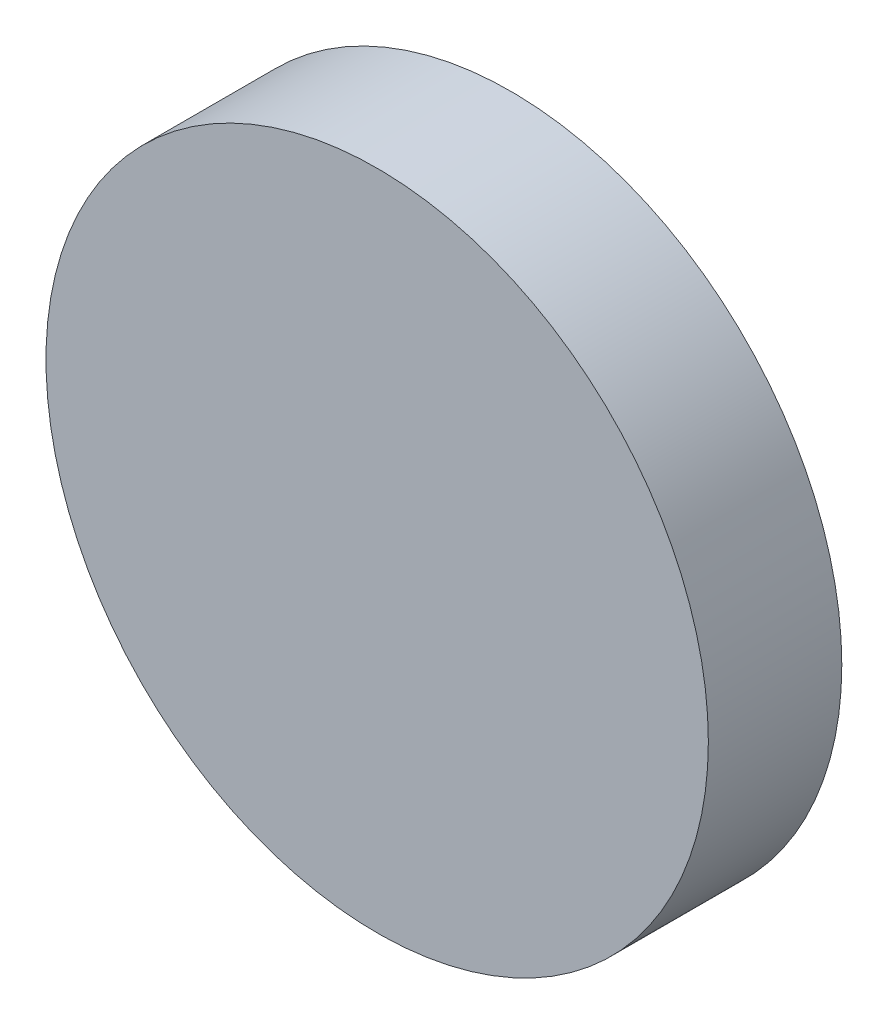
ISO-10303-21;
HEADER;
FILE_DESCRIPTION(('STEP AP214'),'2;1');
FILE_NAME('part.step','',(''),(''),'','','');
FILE_SCHEMA(('AUTOMOTIVE_DESIGN { 1 0 10303 214 1 1 1 1 }'));
ENDSEC;
DATA;
#1=APPLICATION_CONTEXT('core data for automotive mechanical design processes');
#2=APPLICATION_PROTOCOL_DEFINITION('international standard','automotive_design',2000,#1);
#3=PRODUCT_CONTEXT('',#1,'mechanical');
#4=PRODUCT('Part','Part','',(#3));
#5=PRODUCT_RELATED_PRODUCT_CATEGORY('part','',(#4));
#6=PRODUCT_DEFINITION_FORMATION('','',#4);
#7=PRODUCT_DEFINITION_CONTEXT('part definition',#1,'design');
#8=PRODUCT_DEFINITION('design','',#6,#7);
#9=PRODUCT_DEFINITION_SHAPE('','',#8);
#10=(LENGTH_UNIT() NAMED_UNIT(*) SI_UNIT(.MILLI.,.METRE.));
#11=(NAMED_UNIT(*) PLANE_ANGLE_UNIT() SI_UNIT($,.RADIAN.));
#12=(NAMED_UNIT(*) SI_UNIT($,.STERADIAN.) SOLID_ANGLE_UNIT());
#13=UNCERTAINTY_MEASURE_WITH_UNIT(LENGTH_MEASURE(1.E-05),#10,'distance_accuracy_value','');
#14=(GEOMETRIC_REPRESENTATION_CONTEXT(3) GLOBAL_UNCERTAINTY_ASSIGNED_CONTEXT((#13)) GLOBAL_UNIT_ASSIGNED_CONTEXT((#10,
#11,#12)) REPRESENTATION_CONTEXT('',''));
#15=CARTESIAN_POINT('',(0.,0.,0.));
#16=DIRECTION('',(0.,0.,1.));
#17=DIRECTION('',(1.,0.,0.));
#18=AXIS2_PLACEMENT_3D('',#15,#16,#17);
#19=CARTESIAN_POINT('',(0.,0.,53.8));
#20=DIRECTION('',(0.,0.,-1.));
#21=DIRECTION('',(-1.,0.,0.));
#22=AXIS2_PLACEMENT_3D('',#19,#20,#21);
#23=CYLINDRICAL_SURFACE('',#22,133.5);
#24=CARTESIAN_POINT('',(0.,0.,53.8));
#25=DIRECTION('',(0.,0.,1.));
#26=DIRECTION('',(1.,0.,0.));
#27=AXIS2_PLACEMENT_3D('',#24,#25,#26);
#28=CIRCLE('',#27,133.5);
#29=CARTESIAN_POINT('',(133.5,0.,53.8));
#30=VERTEX_POINT('',#29);
#31=EDGE_CURVE('E10',#30,#30,#28,.T.);
#32=ORIENTED_EDGE('',*,*,#31,.F.);
#33=EDGE_LOOP('',(#32));
#34=FACE_BOUND('',#33,.T.);
#35=CARTESIAN_POINT('',(0.,0.,0.));
#36=DIRECTION('',(0.,0.,1.));
#37=DIRECTION('',(1.,0.,0.));
#38=AXIS2_PLACEMENT_3D('',#35,#36,#37);
#39=CIRCLE('',#38,133.5);
#40=CARTESIAN_POINT('',(133.5,0.,0.));
#41=VERTEX_POINT('',#40);
#42=EDGE_CURVE('E35',#41,#41,#39,.T.);
#43=ORIENTED_EDGE('',*,*,#42,.T.);
#44=EDGE_LOOP('',(#43));
#45=FACE_BOUND('',#44,.T.);
#46=ADVANCED_FACE('F32',(#34,#45),#23,.T.);
#47=CARTESIAN_POINT('',(0.,0.,53.8));
#48=DIRECTION('',(0.,0.,1.));
#49=DIRECTION('',(1.,0.,0.));
#50=AXIS2_PLACEMENT_3D('',#47,#48,#49);
#51=PLANE('',#50);
#52=ORIENTED_EDGE('',*,*,#31,.T.);
#53=EDGE_LOOP('',(#52));
#54=FACE_BOUND('',#53,.T.);
#55=ADVANCED_FACE('F47',(#54),#51,.T.);
#56=CARTESIAN_POINT('',(0.,0.,0.));
#57=DIRECTION('',(0.,0.,1.));
#58=DIRECTION('',(1.,0.,0.));
#59=AXIS2_PLACEMENT_3D('',#56,#57,#58);
#60=PLANE('',#59);
#61=ORIENTED_EDGE('',*,*,#42,.F.);
#62=EDGE_LOOP('',(#61));
#63=FACE_BOUND('',#62,.T.);
#64=ADVANCED_FACE('F45',(#63),#60,.F.);
#65=CLOSED_SHELL('',(#46,#55,#64));
#66=MANIFOLD_SOLID_BREP('B2',#65);
#67=ADVANCED_BREP_SHAPE_REPRESENTATION('',(#18,#66),#14);
#68=SHAPE_DEFINITION_REPRESENTATION(#9,#67);
ENDSEC;
END-ISO-10303-21;
